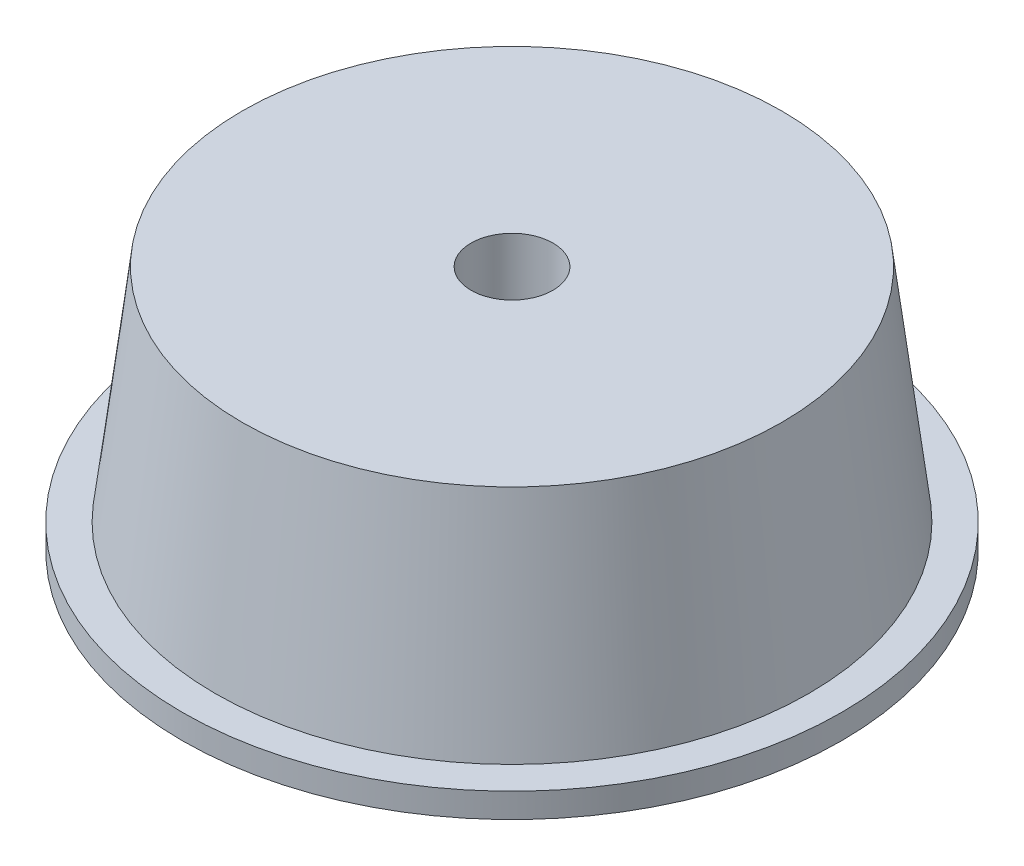
ISO-10303-21;
HEADER;
FILE_DESCRIPTION(('STEP AP214'),'2;1');
FILE_NAME('part.step','',(''),(''),'','','');
FILE_SCHEMA(('AUTOMOTIVE_DESIGN { 1 0 10303 214 1 1 1 1 }'));
ENDSEC;
DATA;
#1=APPLICATION_CONTEXT('core data for automotive mechanical design processes');
#2=APPLICATION_PROTOCOL_DEFINITION('international standard','automotive_design',2000,#1);
#3=PRODUCT_CONTEXT('',#1,'mechanical');
#4=PRODUCT('Part','Part','',(#3));
#5=PRODUCT_RELATED_PRODUCT_CATEGORY('part','',(#4));
#6=PRODUCT_DEFINITION_FORMATION('','',#4);
#7=PRODUCT_DEFINITION_CONTEXT('part definition',#1,'design');
#8=PRODUCT_DEFINITION('design','',#6,#7);
#9=PRODUCT_DEFINITION_SHAPE('','',#8);
#10=(LENGTH_UNIT() NAMED_UNIT(*) SI_UNIT(.MILLI.,.METRE.));
#11=(NAMED_UNIT(*) PLANE_ANGLE_UNIT() SI_UNIT($,.RADIAN.));
#12=(NAMED_UNIT(*) SI_UNIT($,.STERADIAN.) SOLID_ANGLE_UNIT());
#13=UNCERTAINTY_MEASURE_WITH_UNIT(LENGTH_MEASURE(1.E-05),#10,'distance_accuracy_value','');
#14=(GEOMETRIC_REPRESENTATION_CONTEXT(3) GLOBAL_UNCERTAINTY_ASSIGNED_CONTEXT((#13)) GLOBAL_UNIT_ASSIGNED_CONTEXT((#10,
#11,#12)) REPRESENTATION_CONTEXT('',''));
#15=CARTESIAN_POINT('',(0.,0.,0.));
#16=DIRECTION('',(0.,0.,1.));
#17=DIRECTION('',(1.,0.,0.));
#18=AXIS2_PLACEMENT_3D('',#15,#16,#17);
#19=CARTESIAN_POINT('',(0.,0.,7.));
#20=DIRECTION('',(0.,1.,0.));
#21=DIRECTION('',(0.,0.,1.));
#22=AXIS2_PLACEMENT_3D('',#19,#20,#21);
#23=PLANE('',#22);
#24=CARTESIAN_POINT('',(0.,0.,0.));
#25=DIRECTION('',(0.,-1.,0.));
#26=DIRECTION('',(0.,0.,-1.));
#27=AXIS2_PLACEMENT_3D('',#24,#25,#26);
#28=CIRCLE('',#27,2.5);
#29=CARTESIAN_POINT('',(0.,0.,-2.5));
#30=VERTEX_POINT('',#29);
#31=EDGE_CURVE('E62',#30,#30,#28,.T.);
#32=ORIENTED_EDGE('',*,*,#31,.F.);
#33=EDGE_LOOP('',(#32));
#34=FACE_BOUND('',#33,.T.);
#35=CARTESIAN_POINT('',(0.,0.,0.));
#36=DIRECTION('',(0.,-1.,0.));
#37=DIRECTION('',(0.,0.,-1.));
#38=AXIS2_PLACEMENT_3D('',#35,#36,#37);
#39=CIRCLE('',#38,7.);
#40=CARTESIAN_POINT('',(0.,0.,-7.));
#41=VERTEX_POINT('',#40);
#42=EDGE_CURVE('E98',#41,#41,#39,.T.);
#43=ORIENTED_EDGE('',*,*,#42,.T.);
#44=EDGE_LOOP('',(#43));
#45=FACE_BOUND('',#44,.T.);
#46=ADVANCED_FACE('F38',(#34,#45),#23,.F.);
#47=CARTESIAN_POINT('',(0.,0.,0.));
#48=DIRECTION('',(0.,-1.,0.));
#49=DIRECTION('',(0.,0.,-1.));
#50=AXIS2_PLACEMENT_3D('',#47,#48,#49);
#51=CYLINDRICAL_SURFACE('',#50,2.5);
#52=CARTESIAN_POINT('',(0.,5.,0.));
#53=DIRECTION('',(0.,-1.,0.));
#54=DIRECTION('',(0.,0.,-1.));
#55=AXIS2_PLACEMENT_3D('',#52,#53,#54);
#56=CIRCLE('',#55,2.5);
#57=CARTESIAN_POINT('',(0.,5.,-2.5));
#58=VERTEX_POINT('',#57);
#59=EDGE_CURVE('E66',#58,#58,#56,.T.);
#60=ORIENTED_EDGE('',*,*,#59,.F.);
#61=EDGE_LOOP('',(#60));
#62=FACE_BOUND('',#61,.T.);
#63=ORIENTED_EDGE('',*,*,#31,.T.);
#64=EDGE_LOOP('',(#63));
#65=FACE_BOUND('',#64,.T.);
#66=ADVANCED_FACE('F176',(#62,#65),#51,.F.);
#67=CARTESIAN_POINT('',(0.,5.,2.5));
#68=DIRECTION('',(0.,-1.,0.));
#69=DIRECTION('',(0.,0.,-1.));
#70=AXIS2_PLACEMENT_3D('',#67,#68,#69);
#71=PLANE('',#70);
#72=CARTESIAN_POINT('',(0.,5.,0.));
#73=DIRECTION('',(0.,-1.,0.));
#74=DIRECTION('',(0.,0.,-1.));
#75=AXIS2_PLACEMENT_3D('',#72,#73,#74);
#76=CIRCLE('',#75,5.);
#77=CARTESIAN_POINT('',(0.,5.,-5.));
#78=VERTEX_POINT('',#77);
#79=EDGE_CURVE('E70',#78,#78,#76,.T.);
#80=ORIENTED_EDGE('',*,*,#79,.F.);
#81=EDGE_LOOP('',(#80));
#82=FACE_BOUND('',#81,.T.);
#83=ORIENTED_EDGE('',*,*,#59,.T.);
#84=EDGE_LOOP('',(#83));
#85=FACE_BOUND('',#84,.T.);
#86=ADVANCED_FACE('F172',(#82,#85),#71,.F.);
#87=CARTESIAN_POINT('',(0.,0.,0.));
#88=DIRECTION('',(0.,-1.,0.));
#89=DIRECTION('',(0.,0.,-1.));
#90=AXIS2_PLACEMENT_3D('',#87,#88,#89);
#91=CYLINDRICAL_SURFACE('',#90,5.);
#92=CARTESIAN_POINT('',(0.,30.,0.));
#93=DIRECTION('',(0.,-1.,0.));
#94=DIRECTION('',(0.,0.,-1.));
#95=AXIS2_PLACEMENT_3D('',#92,#93,#94);
#96=CIRCLE('',#95,5.);
#97=CARTESIAN_POINT('',(0.,30.,-5.));
#98=VERTEX_POINT('',#97);
#99=EDGE_CURVE('E74',#98,#98,#96,.T.);
#100=ORIENTED_EDGE('',*,*,#99,.F.);
#101=EDGE_LOOP('',(#100));
#102=FACE_BOUND('',#101,.T.);
#103=ORIENTED_EDGE('',*,*,#79,.T.);
#104=EDGE_LOOP('',(#103));
#105=FACE_BOUND('',#104,.T.);
#106=ADVANCED_FACE('F168',(#102,#105),#91,.F.);
#107=CARTESIAN_POINT('',(0.,30.,5.));
#108=DIRECTION('',(0.,-1.,0.));
#109=DIRECTION('',(0.,0.,-1.));
#110=AXIS2_PLACEMENT_3D('',#107,#108,#109);
#111=PLANE('',#110);
#112=CARTESIAN_POINT('',(0.,30.,0.));
#113=DIRECTION('',(0.,-1.,0.));
#114=DIRECTION('',(0.,0.,-1.));
#115=AXIS2_PLACEMENT_3D('',#112,#113,#114);
#116=CIRCLE('',#115,32.9392477338157);
#117=CARTESIAN_POINT('',(0.,30.,-32.9392477338157));
#118=VERTEX_POINT('',#117);
#119=EDGE_CURVE('E78',#118,#118,#116,.T.);
#120=ORIENTED_EDGE('',*,*,#119,.F.);
#121=EDGE_LOOP('',(#120));
#122=FACE_BOUND('',#121,.T.);
#123=ORIENTED_EDGE('',*,*,#99,.T.);
#124=EDGE_LOOP('',(#123));
#125=FACE_BOUND('',#124,.T.);
#126=ADVANCED_FACE('F164',(#122,#125),#111,.F.);
#127=CARTESIAN_POINT('',(0.,30.,0.));
#128=DIRECTION('',(0.,-1.,0.));
#129=DIRECTION('',(0.,0.,-1.));
#130=AXIS2_PLACEMENT_3D('',#127,#128,#129);
#131=CONICAL_SURFACE('',#130,32.9392477338157,0.122173047639607);
#132=CARTESIAN_POINT('',(0.,3.,0.));
#133=DIRECTION('',(0.,-1.,0.));
#134=DIRECTION('',(0.,0.,-1.));
#135=AXIS2_PLACEMENT_3D('',#132,#133,#134);
#136=CIRCLE('',#135,36.2544308781942);
#137=CARTESIAN_POINT('',(0.,3.,-36.2544308781942));
#138=VERTEX_POINT('',#137);
#139=EDGE_CURVE('E82',#138,#138,#136,.T.);
#140=ORIENTED_EDGE('',*,*,#139,.F.);
#141=EDGE_LOOP('',(#140));
#142=FACE_BOUND('',#141,.T.);
#143=ORIENTED_EDGE('',*,*,#119,.T.);
#144=EDGE_LOOP('',(#143));
#145=FACE_BOUND('',#144,.T.);
#146=ADVANCED_FACE('F160',(#142,#145),#131,.T.);
#147=CARTESIAN_POINT('',(0.,3.,40.2544308781942));
#148=DIRECTION('',(0.,-1.,0.));
#149=DIRECTION('',(0.,0.,-1.));
#150=AXIS2_PLACEMENT_3D('',#147,#148,#149);
#151=PLANE('',#150);
#152=CARTESIAN_POINT('',(0.,3.,0.));
#153=DIRECTION('',(0.,-1.,0.));
#154=DIRECTION('',(0.,0.,-1.));
#155=AXIS2_PLACEMENT_3D('',#152,#153,#154);
#156=CIRCLE('',#155,40.2544308781942);
#157=CARTESIAN_POINT('',(0.,3.,-40.2544308781942));
#158=VERTEX_POINT('',#157);
#159=EDGE_CURVE('E86',#158,#158,#156,.T.);
#160=ORIENTED_EDGE('',*,*,#159,.F.);
#161=EDGE_LOOP('',(#160));
#162=FACE_BOUND('',#161,.T.);
#163=ORIENTED_EDGE('',*,*,#139,.T.);
#164=EDGE_LOOP('',(#163));
#165=FACE_BOUND('',#164,.T.);
#166=ADVANCED_FACE('F156',(#162,#165),#151,.F.);
#167=CARTESIAN_POINT('',(0.,0.,0.));
#168=DIRECTION('',(0.,-1.,0.));
#169=DIRECTION('',(0.,0.,-1.));
#170=AXIS2_PLACEMENT_3D('',#167,#168,#169);
#171=CYLINDRICAL_SURFACE('',#170,40.2544308781942);
#172=CARTESIAN_POINT('',(0.,0.,0.));
#173=DIRECTION('',(0.,-1.,0.));
#174=DIRECTION('',(0.,0.,-1.));
#175=AXIS2_PLACEMENT_3D('',#172,#173,#174);
#176=CIRCLE('',#175,40.2544308781942);
#177=CARTESIAN_POINT('',(0.,0.,-40.2544308781942));
#178=VERTEX_POINT('',#177);
#179=EDGE_CURVE('E90',#178,#178,#176,.T.);
#180=ORIENTED_EDGE('',*,*,#179,.F.);
#181=EDGE_LOOP('',(#180));
#182=FACE_BOUND('',#181,.T.);
#183=ORIENTED_EDGE('',*,*,#159,.T.);
#184=EDGE_LOOP('',(#183));
#185=FACE_BOUND('',#184,.T.);
#186=ADVANCED_FACE('F152',(#182,#185),#171,.T.);
#187=CARTESIAN_POINT('',(0.,0.,37.5));
#188=DIRECTION('',(0.,1.,0.));
#189=DIRECTION('',(0.,0.,1.));
#190=AXIS2_PLACEMENT_3D('',#187,#188,#189);
#191=PLANE('',#190);
#192=CARTESIAN_POINT('',(0.,0.,0.));
#193=DIRECTION('',(0.,-1.,0.));
#194=DIRECTION('',(0.,0.,-1.));
#195=AXIS2_PLACEMENT_3D('',#192,#193,#194);
#196=CIRCLE('',#195,34.6077649099852);
#197=CARTESIAN_POINT('',(0.,0.,-34.6077649099852));
#198=VERTEX_POINT('',#197);
#199=EDGE_CURVE('E94',#198,#198,#196,.T.);
#200=ORIENTED_EDGE('',*,*,#199,.F.);
#201=EDGE_LOOP('',(#200));
#202=FACE_BOUND('',#201,.T.);
#203=ORIENTED_EDGE('',*,*,#179,.T.);
#204=EDGE_LOOP('',(#203));
#205=FACE_BOUND('',#204,.T.);
#206=ADVANCED_FACE('F148',(#202,#205),#191,.F.);
#207=CARTESIAN_POINT('',(0.,0.,0.));
#208=DIRECTION('',(0.,-1.,0.));
#209=DIRECTION('',(0.,0.,-1.));
#210=AXIS2_PLACEMENT_3D('',#207,#208,#209);
#211=CONICAL_SURFACE('',#210,34.6077649099852,0.122173047639607);
#212=CARTESIAN_POINT('',(0.,19.2186934340515,0.));
#213=DIRECTION('',(0.,-1.,0.));
#214=DIRECTION('',(0.,0.,-1.));
#215=AXIS2_PLACEMENT_3D('',#212,#213,#214);
#216=CIRCLE('',#215,32.2480060755576);
#217=CARTESIAN_POINT('',(0.,19.2186934340515,-32.2480060755576));
#218=VERTEX_POINT('',#217);
#219=EDGE_CURVE('E51',#218,#218,#216,.F.);
#220=ORIENTED_EDGE('',*,*,#219,.T.);
#221=EDGE_LOOP('',(#220));
#222=FACE_BOUND('',#221,.T.);
#223=ORIENTED_EDGE('',*,*,#199,.T.);
#224=EDGE_LOOP('',(#223));
#225=FACE_BOUND('',#224,.T.);
#226=ADVANCED_FACE('F145',(#222,#225),#211,.F.);
#227=CARTESIAN_POINT('',(0.,28.,7.));
#228=DIRECTION('',(0.,1.,0.));
#229=DIRECTION('',(0.,0.,1.));
#230=AXIS2_PLACEMENT_3D('',#227,#228,#229);
#231=PLANE('',#230);
#232=CARTESIAN_POINT('',(0.,28.,0.));
#233=DIRECTION('',(0.,1.,0.));
#234=DIRECTION('',(0.,0.,1.));
#235=AXIS2_PLACEMENT_3D('',#232,#233,#234);
#236=CIRCLE('',#235,17.);
#237=CARTESIAN_POINT('',(0.,28.,17.));
#238=VERTEX_POINT('',#237);
#239=EDGE_CURVE('E10',#238,#238,#236,.T.);
#240=ORIENTED_EDGE('',*,*,#239,.T.);
#241=EDGE_LOOP('',(#240));
#242=FACE_BOUND('',#241,.T.);
#243=CARTESIAN_POINT('',(0.,28.,0.));
#244=DIRECTION('',(0.,1.,0.));
#245=DIRECTION('',(0.,0.,1.));
#246=AXIS2_PLACEMENT_3D('',#243,#244,#245);
#247=CIRCLE('',#246,22.3225445591444);
#248=CARTESIAN_POINT('',(0.,28.,22.3225445591444));
#249=VERTEX_POINT('',#248);
#250=EDGE_CURVE('E56',#249,#249,#247,.F.);
#251=ORIENTED_EDGE('',*,*,#250,.T.);
#252=EDGE_LOOP('',(#251));
#253=FACE_BOUND('',#252,.T.);
#254=ADVANCED_FACE('F142',(#242,#253),#231,.F.);
#255=CARTESIAN_POINT('',(0.,0.,0.));
#256=DIRECTION('',(0.,-1.,0.));
#257=DIRECTION('',(0.,0.,-1.));
#258=AXIS2_PLACEMENT_3D('',#255,#256,#257);
#259=CYLINDRICAL_SURFACE('',#258,7.);
#260=CARTESIAN_POINT('',(0.,18.,0.));
#261=DIRECTION('',(0.,1.,0.));
#262=DIRECTION('',(0.,0.,1.));
#263=AXIS2_PLACEMENT_3D('',#260,#261,#262);
#264=CIRCLE('',#263,7.);
#265=CARTESIAN_POINT('',(0.,18.,7.));
#266=VERTEX_POINT('',#265);
#267=EDGE_CURVE('E46',#266,#266,#264,.F.);
#268=ORIENTED_EDGE('',*,*,#267,.T.);
#269=EDGE_LOOP('',(#268));
#270=FACE_BOUND('',#269,.T.);
#271=ORIENTED_EDGE('',*,*,#42,.F.);
#272=EDGE_LOOP('',(#271));
#273=FACE_BOUND('',#272,.T.);
#274=ADVANCED_FACE('F138',(#270,#273),#259,.T.);
#275=CARTESIAN_POINT('',(0.,18.,0.));
#276=DIRECTION('',(0.,1.,0.));
#277=DIRECTION('',(0.,0.,1.));
#278=AXIS2_PLACEMENT_3D('',#275,#276,#277);
#279=TOROIDAL_SURFACE('',#278,22.3225445591444,10.);
#280=ORIENTED_EDGE('',*,*,#219,.F.);
#281=EDGE_LOOP('',(#280));
#282=FACE_BOUND('',#281,.T.);
#283=ORIENTED_EDGE('',*,*,#250,.F.);
#284=EDGE_LOOP('',(#283));
#285=FACE_BOUND('',#284,.T.);
#286=ADVANCED_FACE('F141',(#282,#285),#279,.F.);
#287=CARTESIAN_POINT('',(0.,18.,0.));
#288=DIRECTION('',(0.,1.,0.));
#289=DIRECTION('',(0.,0.,1.));
#290=AXIS2_PLACEMENT_3D('',#287,#288,#289);
#291=TOROIDAL_SURFACE('',#290,17.,10.);
#292=ORIENTED_EDGE('',*,*,#239,.F.);
#293=EDGE_LOOP('',(#292));
#294=FACE_BOUND('',#293,.T.);
#295=ORIENTED_EDGE('',*,*,#267,.F.);
#296=EDGE_LOOP('',(#295));
#297=FACE_BOUND('',#296,.T.);
#298=ADVANCED_FACE('F40',(#294,#297),#291,.F.);
#299=CLOSED_SHELL('',(#46,#66,#86,#106,#126,#146,#166,#186,#206,#226,#254,#274,#286,#298));
#300=CARTESIAN_POINT('',(0.,2.,7.));
#301=DIRECTION('',(0.,1.,0.));
#302=DIRECTION('',(0.,0.,1.));
#303=AXIS2_PLACEMENT_3D('',#300,#301,#302);
#304=PLANE('',#303);
#305=CARTESIAN_POINT('',(0.,2.,0.));
#306=DIRECTION('',(0.,-1.,0.));
#307=DIRECTION('',(0.,0.,-1.));
#308=AXIS2_PLACEMENT_3D('',#305,#306,#307);
#309=CIRCLE('',#308,4.5);
#310=CARTESIAN_POINT('',(0.,2.,-4.5));
#311=VERTEX_POINT('',#310);
#312=EDGE_CURVE('E102',#311,#311,#309,.T.);
#313=ORIENTED_EDGE('',*,*,#312,.T.);
#314=EDGE_LOOP('',(#313));
#315=FACE_BOUND('',#314,.T.);
#316=CARTESIAN_POINT('',(0.,2.,0.));
#317=DIRECTION('',(0.,-1.,0.));
#318=DIRECTION('',(0.,0.,-1.));
#319=AXIS2_PLACEMENT_3D('',#316,#317,#318);
#320=CIRCLE('',#319,5.);
#321=CARTESIAN_POINT('',(0.,2.,-5.));
#322=VERTEX_POINT('',#321);
#323=EDGE_CURVE('E114',#322,#322,#320,.T.);
#324=ORIENTED_EDGE('',*,*,#323,.F.);
#325=EDGE_LOOP('',(#324));
#326=FACE_BOUND('',#325,.T.);
#327=ADVANCED_FACE('F122',(#315,#326),#304,.T.);
#328=CARTESIAN_POINT('',(0.,0.,0.));
#329=DIRECTION('',(0.,-1.,0.));
#330=DIRECTION('',(0.,0.,-1.));
#331=AXIS2_PLACEMENT_3D('',#328,#329,#330);
#332=CYLINDRICAL_SURFACE('',#331,4.5);
#333=CARTESIAN_POINT('',(0.,3.,0.));
#334=DIRECTION('',(0.,-1.,0.));
#335=DIRECTION('',(0.,0.,-1.));
#336=AXIS2_PLACEMENT_3D('',#333,#334,#335);
#337=CIRCLE('',#336,4.5);
#338=CARTESIAN_POINT('',(0.,3.,-4.5));
#339=VERTEX_POINT('',#338);
#340=EDGE_CURVE('E106',#339,#339,#337,.T.);
#341=ORIENTED_EDGE('',*,*,#340,.T.);
#342=EDGE_LOOP('',(#341));
#343=FACE_BOUND('',#342,.T.);
#344=ORIENTED_EDGE('',*,*,#312,.F.);
#345=EDGE_LOOP('',(#344));
#346=FACE_BOUND('',#345,.T.);
#347=ADVANCED_FACE('F124',(#343,#346),#332,.T.);
#348=CARTESIAN_POINT('',(0.,3.,2.5));
#349=DIRECTION('',(0.,-1.,0.));
#350=DIRECTION('',(0.,0.,-1.));
#351=AXIS2_PLACEMENT_3D('',#348,#349,#350);
#352=PLANE('',#351);
#353=CARTESIAN_POINT('',(0.,3.,0.));
#354=DIRECTION('',(0.,-1.,0.));
#355=DIRECTION('',(0.,0.,-1.));
#356=AXIS2_PLACEMENT_3D('',#353,#354,#355);
#357=CIRCLE('',#356,5.);
#358=CARTESIAN_POINT('',(0.,3.,-5.));
#359=VERTEX_POINT('',#358);
#360=EDGE_CURVE('E110',#359,#359,#357,.T.);
#361=ORIENTED_EDGE('',*,*,#360,.T.);
#362=EDGE_LOOP('',(#361));
#363=FACE_BOUND('',#362,.T.);
#364=ORIENTED_EDGE('',*,*,#340,.F.);
#365=EDGE_LOOP('',(#364));
#366=FACE_BOUND('',#365,.T.);
#367=ADVANCED_FACE('F132',(#363,#366),#352,.T.);
#368=CARTESIAN_POINT('',(0.,0.,0.));
#369=DIRECTION('',(0.,-1.,0.));
#370=DIRECTION('',(0.,0.,-1.));
#371=AXIS2_PLACEMENT_3D('',#368,#369,#370);
#372=CYLINDRICAL_SURFACE('',#371,5.);
#373=ORIENTED_EDGE('',*,*,#323,.T.);
#374=EDGE_LOOP('',(#373));
#375=FACE_BOUND('',#374,.T.);
#376=ORIENTED_EDGE('',*,*,#360,.F.);
#377=EDGE_LOOP('',(#376));
#378=FACE_BOUND('',#377,.T.);
#379=ADVANCED_FACE('F119',(#375,#378),#372,.F.);
#380=CLOSED_SHELL('',(#327,#347,#367,#379));
#381=ORIENTED_CLOSED_SHELL('',*,#380,.T.);
#382=BREP_WITH_VOIDS('B2',#299,(#381));
#383=ADVANCED_BREP_SHAPE_REPRESENTATION('',(#18,#382),#14);
#384=SHAPE_DEFINITION_REPRESENTATION(#9,#383);
ENDSEC;
END-ISO-10303-21;
